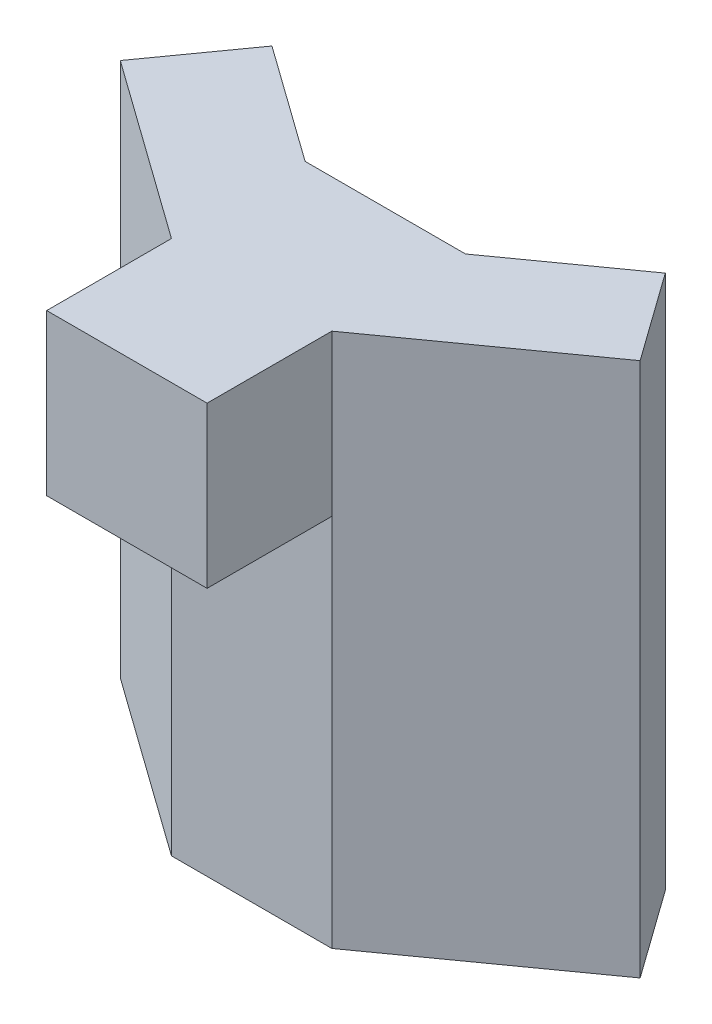
ISO-10303-21;
HEADER;
FILE_DESCRIPTION(('STEP AP214'),'2;1');
FILE_NAME('part.step','',(''),(''),'','','');
FILE_SCHEMA(('AUTOMOTIVE_DESIGN { 1 0 10303 214 1 1 1 1 }'));
ENDSEC;
DATA;
#1=APPLICATION_CONTEXT('core data for automotive mechanical design processes');
#2=APPLICATION_PROTOCOL_DEFINITION('international standard','automotive_design',2000,#1);
#3=PRODUCT_CONTEXT('',#1,'mechanical');
#4=PRODUCT('Part','Part','',(#3));
#5=PRODUCT_RELATED_PRODUCT_CATEGORY('part','',(#4));
#6=PRODUCT_DEFINITION_FORMATION('','',#4);
#7=PRODUCT_DEFINITION_CONTEXT('part definition',#1,'design');
#8=PRODUCT_DEFINITION('design','',#6,#7);
#9=PRODUCT_DEFINITION_SHAPE('','',#8);
#10=(LENGTH_UNIT() NAMED_UNIT(*) SI_UNIT(.MILLI.,.METRE.));
#11=(NAMED_UNIT(*) PLANE_ANGLE_UNIT() SI_UNIT($,.RADIAN.));
#12=(NAMED_UNIT(*) SI_UNIT($,.STERADIAN.) SOLID_ANGLE_UNIT());
#13=UNCERTAINTY_MEASURE_WITH_UNIT(LENGTH_MEASURE(1.E-05),#10,'distance_accuracy_value','');
#14=(GEOMETRIC_REPRESENTATION_CONTEXT(3) GLOBAL_UNCERTAINTY_ASSIGNED_CONTEXT((#13)) GLOBAL_UNIT_ASSIGNED_CONTEXT((#10,
#11,#12)) REPRESENTATION_CONTEXT('',''));
#15=CARTESIAN_POINT('',(0.,0.,0.));
#16=DIRECTION('',(0.,0.,1.));
#17=DIRECTION('',(1.,0.,0.));
#18=AXIS2_PLACEMENT_3D('',#15,#16,#17);
#19=CARTESIAN_POINT('',(45.,300.,0.));
#20=DIRECTION('',(0.,0.,-1.));
#21=DIRECTION('',(-1.,0.,0.));
#22=AXIS2_PLACEMENT_3D('',#19,#20,#21);
#23=PLANE('',#22);
#24=DIRECTION('',(1.,0.,0.));
#25=VECTOR('',#24,1.);
#26=CARTESIAN_POINT('',(45.,210.,0.));
#27=LINE('',#26,#25);
#28=CARTESIAN_POINT('',(-45.,210.,0.));
#29=VERTEX_POINT('',#28);
#30=CARTESIAN_POINT('',(45.,210.,0.));
#31=VERTEX_POINT('',#30);
#32=EDGE_CURVE('E53',#29,#31,#27,.T.);
#33=ORIENTED_EDGE('',*,*,#32,.F.);
#34=DIRECTION('',(0.,-1.,0.));
#35=VECTOR('',#34,1.);
#36=CARTESIAN_POINT('',(-45.,300.,0.));
#37=LINE('',#36,#35);
#38=CARTESIAN_POINT('',(-45.,0.,0.));
#39=VERTEX_POINT('',#38);
#40=EDGE_CURVE('E169',#29,#39,#37,.T.);
#41=ORIENTED_EDGE('',*,*,#40,.T.);
#42=DIRECTION('',(1.,0.,0.));
#43=VECTOR('',#42,1.);
#44=CARTESIAN_POINT('',(45.,0.,0.));
#45=LINE('',#44,#43);
#46=CARTESIAN_POINT('',(45.,0.,0.));
#47=VERTEX_POINT('',#46);
#48=EDGE_CURVE('E185',#39,#47,#45,.T.);
#49=ORIENTED_EDGE('',*,*,#48,.T.);
#50=DIRECTION('',(0.,-1.,0.));
#51=VECTOR('',#50,1.);
#52=CARTESIAN_POINT('',(45.,300.,0.));
#53=LINE('',#52,#51);
#54=EDGE_CURVE('E46',#31,#47,#53,.T.);
#55=ORIENTED_EDGE('',*,*,#54,.F.);
#56=EDGE_LOOP('',(#33,#41,#49,#55));
#57=FACE_BOUND('',#56,.T.);
#58=ADVANCED_FACE('F39',(#57),#23,.F.);
#59=CARTESIAN_POINT('',(145.853333333333,300.,-72.1429494514576));
#60=DIRECTION('',(-0.581797979447238,0.,-0.813333333333333));
#61=DIRECTION('',(-0.813333333333333,0.,0.581797979447238));
#62=AXIS2_PLACEMENT_3D('',#59,#60,#61);
#63=PLANE('',#62);
#64=DIRECTION('',(0.813333333333333,0.,-0.581797979447238));
#65=VECTOR('',#64,1.);
#66=CARTESIAN_POINT('',(145.853333333333,0.,-72.1429494514576));
#67=LINE('',#66,#65);
#68=CARTESIAN_POINT('',(145.853333333333,0.,-72.1429494514576));
#69=VERTEX_POINT('',#68);
#70=EDGE_CURVE('E196',#47,#69,#67,.T.);
#71=ORIENTED_EDGE('',*,*,#70,.T.);
#72=DIRECTION('',(0.,-1.,0.));
#73=VECTOR('',#72,1.);
#74=CARTESIAN_POINT('',(145.853333333333,300.,-72.1429494514576));
#75=LINE('',#74,#73);
#76=CARTESIAN_POINT('',(145.853333333333,300.,-72.1429494514576));
#77=VERTEX_POINT('',#76);
#78=EDGE_CURVE('E204',#77,#69,#75,.T.);
#79=ORIENTED_EDGE('',*,*,#78,.F.);
#80=DIRECTION('',(0.813333333333333,0.,-0.581797979447238));
#81=VECTOR('',#80,1.);
#82=CARTESIAN_POINT('',(145.853333333333,300.,-72.1429494514576));
#83=LINE('',#82,#81);
#84=CARTESIAN_POINT('',(45.,300.,0.));
#85=VERTEX_POINT('',#84);
#86=EDGE_CURVE('E90',#85,#77,#83,.T.);
#87=ORIENTED_EDGE('',*,*,#86,.F.);
#88=EDGE_CURVE('E11',#85,#31,#53,.T.);
#89=ORIENTED_EDGE('',*,*,#88,.T.);
#90=ORIENTED_EDGE('',*,*,#54,.T.);
#91=EDGE_LOOP('',(#71,#79,#87,#89,#90));
#92=FACE_BOUND('',#91,.T.);
#93=ADVANCED_FACE('F210',(#92),#63,.F.);
#94=CARTESIAN_POINT('',(110.363656587052,300.,-121.756282784791));
#95=DIRECTION('',(-0.813333333333333,0.,0.581797979447238));
#96=DIRECTION('',(0.581797979447238,0.,0.813333333333333));
#97=AXIS2_PLACEMENT_3D('',#94,#95,#96);
#98=PLANE('',#97);
#99=DIRECTION('',(-0.581797979447238,0.,-0.813333333333333));
#100=VECTOR('',#99,1.);
#101=CARTESIAN_POINT('',(110.363656587052,0.,-121.756282784791));
#102=LINE('',#101,#100);
#103=CARTESIAN_POINT('',(110.363656587052,0.,-121.756282784791));
#104=VERTEX_POINT('',#103);
#105=EDGE_CURVE('E198',#69,#104,#102,.T.);
#106=ORIENTED_EDGE('',*,*,#105,.T.);
#107=DIRECTION('',(0.,-1.,0.));
#108=VECTOR('',#107,1.);
#109=CARTESIAN_POINT('',(110.363656587052,300.,-121.756282784791));
#110=LINE('',#109,#108);
#111=CARTESIAN_POINT('',(110.363656587052,300.,-121.756282784791));
#112=VERTEX_POINT('',#111);
#113=EDGE_CURVE('E203',#112,#104,#110,.T.);
#114=ORIENTED_EDGE('',*,*,#113,.F.);
#115=DIRECTION('',(-0.581797979447238,0.,-0.813333333333333));
#116=VECTOR('',#115,1.);
#117=CARTESIAN_POINT('',(110.363656587052,300.,-121.756282784791));
#118=LINE('',#117,#116);
#119=EDGE_CURVE('E187',#77,#112,#118,.T.);
#120=ORIENTED_EDGE('',*,*,#119,.F.);
#121=ORIENTED_EDGE('',*,*,#78,.T.);
#122=EDGE_LOOP('',(#106,#114,#120,#121));
#123=FACE_BOUND('',#122,.T.);
#124=ADVANCED_FACE('F241',(#123),#98,.F.);
#125=CARTESIAN_POINT('',(45.,300.,-75.));
#126=DIRECTION('',(0.581797979447239,0.,0.813333333333333));
#127=DIRECTION('',(0.813333333333333,0.,-0.581797979447239));
#128=AXIS2_PLACEMENT_3D('',#125,#126,#127);
#129=PLANE('',#128);
#130=DIRECTION('',(-0.813333333333333,0.,0.581797979447239));
#131=VECTOR('',#130,1.);
#132=CARTESIAN_POINT('',(45.,0.,-75.));
#133=LINE('',#132,#131);
#134=CARTESIAN_POINT('',(45.,0.,-75.));
#135=VERTEX_POINT('',#134);
#136=EDGE_CURVE('E83',#104,#135,#133,.T.);
#137=ORIENTED_EDGE('',*,*,#136,.T.);
#138=DIRECTION('',(0.,-1.,0.));
#139=VECTOR('',#138,1.);
#140=CARTESIAN_POINT('',(45.,300.,-75.));
#141=LINE('',#140,#139);
#142=CARTESIAN_POINT('',(45.,300.,-75.));
#143=VERTEX_POINT('',#142);
#144=EDGE_CURVE('E193',#143,#135,#141,.T.);
#145=ORIENTED_EDGE('',*,*,#144,.F.);
#146=DIRECTION('',(-0.813333333333333,0.,0.581797979447239));
#147=VECTOR('',#146,1.);
#148=CARTESIAN_POINT('',(45.,300.,-75.));
#149=LINE('',#148,#147);
#150=EDGE_CURVE('E62',#112,#143,#149,.T.);
#151=ORIENTED_EDGE('',*,*,#150,.F.);
#152=ORIENTED_EDGE('',*,*,#113,.T.);
#153=EDGE_LOOP('',(#137,#145,#151,#152));
#154=FACE_BOUND('',#153,.T.);
#155=ADVANCED_FACE('F246',(#154),#129,.F.);
#156=CARTESIAN_POINT('',(0.,300.,-75.));
#157=DIRECTION('',(0.,0.,1.));
#158=DIRECTION('',(1.,0.,0.));
#159=AXIS2_PLACEMENT_3D('',#156,#157,#158);
#160=PLANE('',#159);
#161=DIRECTION('',(-1.,0.,0.));
#162=VECTOR('',#161,1.);
#163=CARTESIAN_POINT('',(0.,0.,-75.));
#164=LINE('',#163,#162);
#165=CARTESIAN_POINT('',(-45.,0.,-75.));
#166=VERTEX_POINT('',#165);
#167=EDGE_CURVE('E188',#135,#166,#164,.T.);
#168=ORIENTED_EDGE('',*,*,#167,.T.);
#169=DIRECTION('',(0.,-1.,0.));
#170=VECTOR('',#169,1.);
#171=CARTESIAN_POINT('',(-45.,300.,-75.));
#172=LINE('',#171,#170);
#173=CARTESIAN_POINT('',(-45.,300.,-75.));
#174=VERTEX_POINT('',#173);
#175=EDGE_CURVE('E182',#174,#166,#172,.T.);
#176=ORIENTED_EDGE('',*,*,#175,.F.);
#177=DIRECTION('',(-1.,0.,0.));
#178=VECTOR('',#177,1.);
#179=CARTESIAN_POINT('',(0.,300.,-75.));
#180=LINE('',#179,#178);
#181=EDGE_CURVE('E191',#143,#174,#180,.T.);
#182=ORIENTED_EDGE('',*,*,#181,.F.);
#183=ORIENTED_EDGE('',*,*,#144,.T.);
#184=EDGE_LOOP('',(#168,#176,#182,#183));
#185=FACE_BOUND('',#184,.T.);
#186=ADVANCED_FACE('F251',(#185),#160,.F.);
#187=CARTESIAN_POINT('',(0.,300.,0.));
#188=DIRECTION('',(0.,-1.,0.));
#189=DIRECTION('',(0.,0.,-1.));
#190=AXIS2_PLACEMENT_3D('',#187,#188,#189);
#191=PLANE('',#190);
#192=DIRECTION('',(-0.813333333333333,0.,-0.581797979447238));
#193=VECTOR('',#192,1.);
#194=CARTESIAN_POINT('',(-145.853333333333,300.,-72.1429494514576));
#195=LINE('',#194,#193);
#196=CARTESIAN_POINT('',(-45.,300.,0.));
#197=VERTEX_POINT('',#196);
#198=CARTESIAN_POINT('',(-145.853333333333,300.,-72.1429494514576));
#199=VERTEX_POINT('',#198);
#200=EDGE_CURVE('E167',#197,#199,#195,.T.);
#201=ORIENTED_EDGE('',*,*,#200,.F.);
#202=DIRECTION('',(0.,0.,-1.));
#203=VECTOR('',#202,1.);
#204=CARTESIAN_POINT('',(-45.,300.,70.));
#205=LINE('',#204,#203);
#206=CARTESIAN_POINT('',(-45.,300.,70.));
#207=VERTEX_POINT('',#206);
#208=EDGE_CURVE('E136',#207,#197,#205,.T.);
#209=ORIENTED_EDGE('',*,*,#208,.F.);
#210=DIRECTION('',(-1.,0.,0.));
#211=VECTOR('',#210,1.);
#212=CARTESIAN_POINT('',(45.,300.,70.));
#213=LINE('',#212,#211);
#214=CARTESIAN_POINT('',(45.,300.,70.));
#215=VERTEX_POINT('',#214);
#216=EDGE_CURVE('E128',#215,#207,#213,.T.);
#217=ORIENTED_EDGE('',*,*,#216,.F.);
#218=DIRECTION('',(0.,0.,-1.));
#219=VECTOR('',#218,1.);
#220=CARTESIAN_POINT('',(45.,300.,70.));
#221=LINE('',#220,#219);
#222=EDGE_CURVE('E133',#215,#85,#221,.T.);
#223=ORIENTED_EDGE('',*,*,#222,.T.);
#224=ORIENTED_EDGE('',*,*,#86,.T.);
#225=ORIENTED_EDGE('',*,*,#119,.T.);
#226=ORIENTED_EDGE('',*,*,#150,.T.);
#227=ORIENTED_EDGE('',*,*,#181,.T.);
#228=DIRECTION('',(0.813333333333333,0.,0.581797979447239));
#229=VECTOR('',#228,1.);
#230=CARTESIAN_POINT('',(-45.,300.,-75.));
#231=LINE('',#230,#229);
#232=CARTESIAN_POINT('',(-110.363656587052,300.,-121.756282784791));
#233=VERTEX_POINT('',#232);
#234=EDGE_CURVE('E160',#233,#174,#231,.T.);
#235=ORIENTED_EDGE('',*,*,#234,.F.);
#236=DIRECTION('',(0.581797979447238,0.,-0.813333333333333));
#237=VECTOR('',#236,1.);
#238=CARTESIAN_POINT('',(-110.363656587052,300.,-121.756282784791));
#239=LINE('',#238,#237);
#240=EDGE_CURVE('E163',#199,#233,#239,.T.);
#241=ORIENTED_EDGE('',*,*,#240,.F.);
#242=EDGE_LOOP('',(#201,#209,#217,#223,#224,#225,#226,#227,#235,#241));
#243=FACE_BOUND('',#242,.T.);
#244=ADVANCED_FACE('F131',(#243),#191,.F.);
#245=CARTESIAN_POINT('',(0.,0.,0.));
#246=DIRECTION('',(0.,-1.,0.));
#247=DIRECTION('',(0.,0.,-1.));
#248=AXIS2_PLACEMENT_3D('',#245,#246,#247);
#249=PLANE('',#248);
#250=ORIENTED_EDGE('',*,*,#48,.F.);
#251=DIRECTION('',(-0.813333333333333,0.,-0.581797979447238));
#252=VECTOR('',#251,1.);
#253=CARTESIAN_POINT('',(-145.853333333333,0.,-72.1429494514576));
#254=LINE('',#253,#252);
#255=CARTESIAN_POINT('',(-145.853333333333,0.,-72.1429494514576));
#256=VERTEX_POINT('',#255);
#257=EDGE_CURVE('E164',#39,#256,#254,.T.);
#258=ORIENTED_EDGE('',*,*,#257,.T.);
#259=DIRECTION('',(0.581797979447238,0.,-0.813333333333333));
#260=VECTOR('',#259,1.);
#261=CARTESIAN_POINT('',(-110.363656587052,0.,-121.756282784791));
#262=LINE('',#261,#260);
#263=CARTESIAN_POINT('',(-110.363656587052,0.,-121.756282784791));
#264=VERTEX_POINT('',#263);
#265=EDGE_CURVE('E154',#256,#264,#262,.T.);
#266=ORIENTED_EDGE('',*,*,#265,.T.);
#267=DIRECTION('',(0.813333333333333,0.,0.581797979447239));
#268=VECTOR('',#267,1.);
#269=CARTESIAN_POINT('',(-45.,0.,-75.));
#270=LINE('',#269,#268);
#271=EDGE_CURVE('E151',#264,#166,#270,.T.);
#272=ORIENTED_EDGE('',*,*,#271,.T.);
#273=ORIENTED_EDGE('',*,*,#167,.F.);
#274=ORIENTED_EDGE('',*,*,#136,.F.);
#275=ORIENTED_EDGE('',*,*,#105,.F.);
#276=ORIENTED_EDGE('',*,*,#70,.F.);
#277=EDGE_LOOP('',(#250,#258,#266,#272,#273,#274,#275,#276));
#278=FACE_BOUND('',#277,.T.);
#279=ADVANCED_FACE('F213',(#278),#249,.T.);
#280=CARTESIAN_POINT('',(-45.,300.,-75.));
#281=DIRECTION('',(0.581797979447239,0.,-0.813333333333333));
#282=DIRECTION('',(-0.813333333333333,0.,-0.581797979447239));
#283=AXIS2_PLACEMENT_3D('',#280,#281,#282);
#284=PLANE('',#283);
#285=ORIENTED_EDGE('',*,*,#271,.F.);
#286=DIRECTION('',(0.,-1.,0.));
#287=VECTOR('',#286,1.);
#288=CARTESIAN_POINT('',(-110.363656587052,300.,-121.756282784791));
#289=LINE('',#288,#287);
#290=EDGE_CURVE('E180',#233,#264,#289,.T.);
#291=ORIENTED_EDGE('',*,*,#290,.F.);
#292=ORIENTED_EDGE('',*,*,#234,.T.);
#293=ORIENTED_EDGE('',*,*,#175,.T.);
#294=EDGE_LOOP('',(#285,#291,#292,#293));
#295=FACE_BOUND('',#294,.T.);
#296=ADVANCED_FACE('F257',(#295),#284,.T.);
#297=CARTESIAN_POINT('',(-110.363656587052,300.,-121.756282784791));
#298=DIRECTION('',(-0.813333333333333,0.,-0.581797979447238));
#299=DIRECTION('',(-0.581797979447238,0.,0.813333333333333));
#300=AXIS2_PLACEMENT_3D('',#297,#298,#299);
#301=PLANE('',#300);
#302=ORIENTED_EDGE('',*,*,#265,.F.);
#303=DIRECTION('',(0.,-1.,0.));
#304=VECTOR('',#303,1.);
#305=CARTESIAN_POINT('',(-145.853333333333,300.,-72.1429494514576));
#306=LINE('',#305,#304);
#307=EDGE_CURVE('E178',#199,#256,#306,.T.);
#308=ORIENTED_EDGE('',*,*,#307,.F.);
#309=ORIENTED_EDGE('',*,*,#240,.T.);
#310=ORIENTED_EDGE('',*,*,#290,.T.);
#311=EDGE_LOOP('',(#302,#308,#309,#310));
#312=FACE_BOUND('',#311,.T.);
#313=ADVANCED_FACE('F261',(#312),#301,.T.);
#314=CARTESIAN_POINT('',(-145.853333333333,300.,-72.1429494514576));
#315=DIRECTION('',(-0.581797979447238,0.,0.813333333333333));
#316=DIRECTION('',(0.813333333333333,0.,0.581797979447238));
#317=AXIS2_PLACEMENT_3D('',#314,#315,#316);
#318=PLANE('',#317);
#319=ORIENTED_EDGE('',*,*,#257,.F.);
#320=ORIENTED_EDGE('',*,*,#40,.F.);
#321=EDGE_CURVE('E175',#197,#29,#37,.T.);
#322=ORIENTED_EDGE('',*,*,#321,.F.);
#323=ORIENTED_EDGE('',*,*,#200,.T.);
#324=ORIENTED_EDGE('',*,*,#307,.T.);
#325=EDGE_LOOP('',(#319,#320,#322,#323,#324));
#326=FACE_BOUND('',#325,.T.);
#327=ADVANCED_FACE('F216',(#326),#318,.T.);
#328=CARTESIAN_POINT('',(45.,300.,70.));
#329=DIRECTION('',(-1.,0.,0.));
#330=DIRECTION('',(0.,-1.,0.));
#331=AXIS2_PLACEMENT_3D('',#328,#329,#330);
#332=PLANE('',#331);
#333=ORIENTED_EDGE('',*,*,#88,.F.);
#334=ORIENTED_EDGE('',*,*,#222,.F.);
#335=DIRECTION('',(0.,1.,0.));
#336=VECTOR('',#335,1.);
#337=CARTESIAN_POINT('',(45.,300.,70.));
#338=LINE('',#337,#336);
#339=CARTESIAN_POINT('',(45.,210.,70.));
#340=VERTEX_POINT('',#339);
#341=EDGE_CURVE('E140',#340,#215,#338,.T.);
#342=ORIENTED_EDGE('',*,*,#341,.F.);
#343=DIRECTION('',(0.,0.,-1.));
#344=VECTOR('',#343,1.);
#345=CARTESIAN_POINT('',(45.,210.,70.));
#346=LINE('',#345,#344);
#347=EDGE_CURVE('E223',#340,#31,#346,.T.);
#348=ORIENTED_EDGE('',*,*,#347,.T.);
#349=EDGE_LOOP('',(#333,#334,#342,#348));
#350=FACE_BOUND('',#349,.T.);
#351=ADVANCED_FACE('F150',(#350),#332,.F.);
#352=CARTESIAN_POINT('',(-45.,300.,70.));
#353=DIRECTION('',(1.,0.,0.));
#354=DIRECTION('',(0.,0.,-1.));
#355=AXIS2_PLACEMENT_3D('',#352,#353,#354);
#356=PLANE('',#355);
#357=ORIENTED_EDGE('',*,*,#321,.T.);
#358=DIRECTION('',(0.,0.,-1.));
#359=VECTOR('',#358,1.);
#360=CARTESIAN_POINT('',(-45.,210.,70.));
#361=LINE('',#360,#359);
#362=CARTESIAN_POINT('',(-45.,210.,70.));
#363=VERTEX_POINT('',#362);
#364=EDGE_CURVE('E156',#363,#29,#361,.T.);
#365=ORIENTED_EDGE('',*,*,#364,.F.);
#366=DIRECTION('',(0.,-1.,0.));
#367=VECTOR('',#366,1.);
#368=CARTESIAN_POINT('',(-45.,300.,70.));
#369=LINE('',#368,#367);
#370=EDGE_CURVE('E139',#207,#363,#369,.T.);
#371=ORIENTED_EDGE('',*,*,#370,.F.);
#372=ORIENTED_EDGE('',*,*,#208,.T.);
#373=EDGE_LOOP('',(#357,#365,#371,#372));
#374=FACE_BOUND('',#373,.T.);
#375=ADVANCED_FACE('F220',(#374),#356,.F.);
#376=CARTESIAN_POINT('',(45.,210.,70.));
#377=DIRECTION('',(0.,1.,0.));
#378=DIRECTION('',(-1.,0.,0.));
#379=AXIS2_PLACEMENT_3D('',#376,#377,#378);
#380=PLANE('',#379);
#381=ORIENTED_EDGE('',*,*,#32,.T.);
#382=ORIENTED_EDGE('',*,*,#347,.F.);
#383=DIRECTION('',(1.,0.,0.));
#384=VECTOR('',#383,1.);
#385=CARTESIAN_POINT('',(45.,210.,70.));
#386=LINE('',#385,#384);
#387=EDGE_CURVE('E145',#363,#340,#386,.T.);
#388=ORIENTED_EDGE('',*,*,#387,.F.);
#389=ORIENTED_EDGE('',*,*,#364,.T.);
#390=EDGE_LOOP('',(#381,#382,#388,#389));
#391=FACE_BOUND('',#390,.T.);
#392=ADVANCED_FACE('F222',(#391),#380,.F.);
#393=CARTESIAN_POINT('',(0.,0.,70.));
#394=DIRECTION('',(0.,0.,-1.));
#395=DIRECTION('',(-1.,0.,0.));
#396=AXIS2_PLACEMENT_3D('',#393,#394,#395);
#397=PLANE('',#396);
#398=ORIENTED_EDGE('',*,*,#341,.T.);
#399=ORIENTED_EDGE('',*,*,#216,.T.);
#400=ORIENTED_EDGE('',*,*,#370,.T.);
#401=ORIENTED_EDGE('',*,*,#387,.T.);
#402=EDGE_LOOP('',(#398,#399,#400,#401));
#403=FACE_BOUND('',#402,.T.);
#404=ADVANCED_FACE('F143',(#403),#397,.F.);
#405=CLOSED_SHELL('',(#58,#93,#124,#155,#186,#244,#279,#296,#313,#327,#351,#375,#392,#404));
#406=MANIFOLD_SOLID_BREP('B2',#405);
#407=ADVANCED_BREP_SHAPE_REPRESENTATION('',(#18,#406),#14);
#408=SHAPE_DEFINITION_REPRESENTATION(#9,#407);
ENDSEC;
END-ISO-10303-21;
